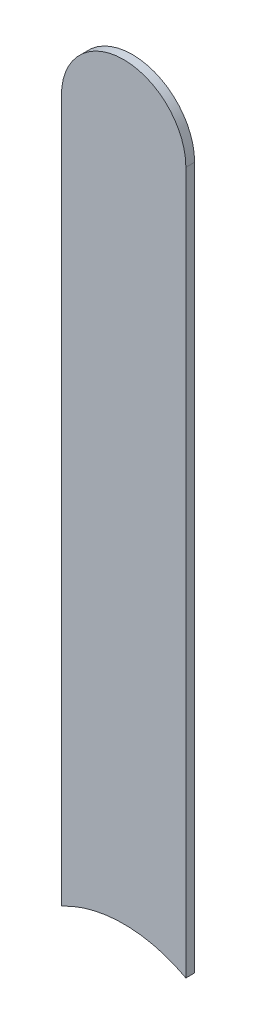
ISO-10303-21;
HEADER;
FILE_DESCRIPTION(('STEP AP214'),'2;1');
FILE_NAME('part.step','',(''),(''),'','','');
FILE_SCHEMA(('AUTOMOTIVE_DESIGN { 1 0 10303 214 1 1 1 1 }'));
ENDSEC;
DATA;
#1=APPLICATION_CONTEXT('core data for automotive mechanical design processes');
#2=APPLICATION_PROTOCOL_DEFINITION('international standard','automotive_design',2000,#1);
#3=PRODUCT_CONTEXT('',#1,'mechanical');
#4=PRODUCT('Part','Part','',(#3));
#5=PRODUCT_RELATED_PRODUCT_CATEGORY('part','',(#4));
#6=PRODUCT_DEFINITION_FORMATION('','',#4);
#7=PRODUCT_DEFINITION_CONTEXT('part definition',#1,'design');
#8=PRODUCT_DEFINITION('design','',#6,#7);
#9=PRODUCT_DEFINITION_SHAPE('','',#8);
#10=(LENGTH_UNIT() NAMED_UNIT(*) SI_UNIT(.MILLI.,.METRE.));
#11=(NAMED_UNIT(*) PLANE_ANGLE_UNIT() SI_UNIT($,.RADIAN.));
#12=(NAMED_UNIT(*) SI_UNIT($,.STERADIAN.) SOLID_ANGLE_UNIT());
#13=UNCERTAINTY_MEASURE_WITH_UNIT(LENGTH_MEASURE(1.E-05),#10,'distance_accuracy_value','');
#14=(GEOMETRIC_REPRESENTATION_CONTEXT(3) GLOBAL_UNCERTAINTY_ASSIGNED_CONTEXT((#13)) GLOBAL_UNIT_ASSIGNED_CONTEXT((#10,
#11,#12)) REPRESENTATION_CONTEXT('',''));
#15=CARTESIAN_POINT('',(0.,0.,0.));
#16=DIRECTION('',(0.,0.,1.));
#17=DIRECTION('',(1.,0.,0.));
#18=AXIS2_PLACEMENT_3D('',#15,#16,#17);
#19=CARTESIAN_POINT('',(126.552,-108.402,-0.035));
#20=DIRECTION('',(1.,0.,0.));
#21=DIRECTION('',(0.,1.,0.));
#22=AXIS2_PLACEMENT_3D('',#19,#20,#21);
#23=PLANE('',#22);
#24=DIRECTION('',(0.,0.,-1.));
#25=VECTOR('',#24,1.);
#26=CARTESIAN_POINT('',(126.552,-111.2223453671,-0.045));
#27=LINE('',#26,#25);
#28=CARTESIAN_POINT('',(126.552,-111.2223453671,0.));
#29=VERTEX_POINT('',#28);
#30=CARTESIAN_POINT('',(126.552,-111.2223453671,-0.035));
#31=VERTEX_POINT('',#30);
#32=EDGE_CURVE('E11',#29,#31,#27,.T.);
#33=ORIENTED_EDGE('',*,*,#32,.F.);
#34=DIRECTION('',(0.,-1.,0.));
#35=VECTOR('',#34,1.);
#36=CARTESIAN_POINT('',(126.552,-108.402,0.));
#37=LINE('',#36,#35);
#38=CARTESIAN_POINT('',(126.552,-108.402,0.));
#39=VERTEX_POINT('',#38);
#40=EDGE_CURVE('E20',#39,#29,#37,.T.);
#41=ORIENTED_EDGE('',*,*,#40,.F.);
#42=DIRECTION('',(0.,0.,1.));
#43=VECTOR('',#42,1.);
#44=CARTESIAN_POINT('',(126.552,-108.402,-0.035));
#45=LINE('',#44,#43);
#46=CARTESIAN_POINT('',(126.552,-108.402,-0.035));
#47=VERTEX_POINT('',#46);
#48=EDGE_CURVE('E105',#47,#39,#45,.T.);
#49=ORIENTED_EDGE('',*,*,#48,.F.);
#50=DIRECTION('',(0.,-1.,0.));
#51=VECTOR('',#50,1.);
#52=CARTESIAN_POINT('',(126.552,-108.402,-0.035));
#53=LINE('',#52,#51);
#54=EDGE_CURVE('E72',#47,#31,#53,.T.);
#55=ORIENTED_EDGE('',*,*,#54,.T.);
#56=EDGE_LOOP('',(#33,#41,#49,#55));
#57=FACE_BOUND('',#56,.T.);
#58=ADVANCED_FACE('F17',(#57),#23,.F.);
#59=CARTESIAN_POINT('',(126.802,-111.684,-0.045));
#60=DIRECTION('',(0.,0.,-1.));
#61=DIRECTION('',(0.,-1.,0.));
#62=AXIS2_PLACEMENT_3D('',#59,#60,#61);
#63=CYLINDRICAL_SURFACE('',#62,0.525);
#64=DIRECTION('',(0.,0.,-1.));
#65=VECTOR('',#64,1.);
#66=CARTESIAN_POINT('',(127.052,-111.2223453671,-0.045));
#67=LINE('',#66,#65);
#68=CARTESIAN_POINT('',(127.052,-111.2223453671,0.));
#69=VERTEX_POINT('',#68);
#70=CARTESIAN_POINT('',(127.052,-111.2223453671,-0.035));
#71=VERTEX_POINT('',#70);
#72=EDGE_CURVE('E85',#69,#71,#67,.T.);
#73=ORIENTED_EDGE('',*,*,#72,.F.);
#74=CARTESIAN_POINT('',(126.802,-111.684,0.));
#75=DIRECTION('',(0.,0.,-1.));
#76=DIRECTION('',(0.,-1.,0.));
#77=AXIS2_PLACEMENT_3D('',#74,#75,#76);
#78=CIRCLE('',#77,0.525);
#79=EDGE_CURVE('E110',#29,#69,#78,.T.);
#80=ORIENTED_EDGE('',*,*,#79,.F.);
#81=ORIENTED_EDGE('',*,*,#32,.T.);
#82=CARTESIAN_POINT('',(126.802,-111.684,-0.035));
#83=DIRECTION('',(0.,0.,-1.));
#84=DIRECTION('',(0.,-1.,0.));
#85=AXIS2_PLACEMENT_3D('',#82,#83,#84);
#86=CIRCLE('',#85,0.525);
#87=EDGE_CURVE('E77',#31,#71,#86,.T.);
#88=ORIENTED_EDGE('',*,*,#87,.T.);
#89=EDGE_LOOP('',(#73,#80,#81,#88));
#90=FACE_BOUND('',#89,.T.);
#91=ADVANCED_FACE('F121',(#90),#63,.F.);
#92=CARTESIAN_POINT('',(127.052,-111.684,0.));
#93=DIRECTION('',(0.,0.,1.));
#94=DIRECTION('',(1.,0.,0.));
#95=AXIS2_PLACEMENT_3D('',#92,#93,#94);
#96=PLANE('',#95);
#97=ORIENTED_EDGE('',*,*,#79,.T.);
#98=DIRECTION('',(0.,1.,0.));
#99=VECTOR('',#98,1.);
#100=CARTESIAN_POINT('',(127.052,-111.684,0.));
#101=LINE('',#100,#99);
#102=CARTESIAN_POINT('',(127.052,-108.402,0.));
#103=VERTEX_POINT('',#102);
#104=EDGE_CURVE('E93',#69,#103,#101,.T.);
#105=ORIENTED_EDGE('',*,*,#104,.T.);
#106=CARTESIAN_POINT('',(126.802,-108.402,0.));
#107=DIRECTION('',(0.,0.,1.));
#108=DIRECTION('',(1.,0.,0.));
#109=AXIS2_PLACEMENT_3D('',#106,#107,#108);
#110=CIRCLE('',#109,0.25);
#111=EDGE_CURVE('E90',#103,#39,#110,.T.);
#112=ORIENTED_EDGE('',*,*,#111,.T.);
#113=ORIENTED_EDGE('',*,*,#40,.T.);
#114=EDGE_LOOP('',(#97,#105,#112,#113));
#115=FACE_BOUND('',#114,.T.);
#116=ADVANCED_FACE('F119',(#115),#96,.T.);
#117=CARTESIAN_POINT('',(126.802,-108.402,-0.035));
#118=DIRECTION('',(0.,0.,-1.));
#119=DIRECTION('',(1.,0.,0.));
#120=AXIS2_PLACEMENT_3D('',#117,#118,#119);
#121=CYLINDRICAL_SURFACE('',#120,0.25);
#122=CARTESIAN_POINT('',(126.802,-108.402,-0.035));
#123=DIRECTION('',(0.,0.,1.));
#124=DIRECTION('',(1.,0.,0.));
#125=AXIS2_PLACEMENT_3D('',#122,#123,#124);
#126=CIRCLE('',#125,0.25);
#127=CARTESIAN_POINT('',(127.052,-108.402,-0.035));
#128=VERTEX_POINT('',#127);
#129=EDGE_CURVE('E66',#128,#47,#126,.T.);
#130=ORIENTED_EDGE('',*,*,#129,.T.);
#131=ORIENTED_EDGE('',*,*,#48,.T.);
#132=ORIENTED_EDGE('',*,*,#111,.F.);
#133=DIRECTION('',(0.,0.,1.));
#134=VECTOR('',#133,1.);
#135=CARTESIAN_POINT('',(127.052,-108.402,-0.035));
#136=LINE('',#135,#134);
#137=EDGE_CURVE('E83',#128,#103,#136,.T.);
#138=ORIENTED_EDGE('',*,*,#137,.F.);
#139=EDGE_LOOP('',(#130,#131,#132,#138));
#140=FACE_BOUND('',#139,.T.);
#141=ADVANCED_FACE('F88',(#140),#121,.T.);
#142=CARTESIAN_POINT('',(127.052,-111.684,-0.035));
#143=DIRECTION('',(0.,0.,1.));
#144=DIRECTION('',(1.,0.,0.));
#145=AXIS2_PLACEMENT_3D('',#142,#143,#144);
#146=PLANE('',#145);
#147=ORIENTED_EDGE('',*,*,#54,.F.);
#148=ORIENTED_EDGE('',*,*,#129,.F.);
#149=DIRECTION('',(0.,1.,0.));
#150=VECTOR('',#149,1.);
#151=CARTESIAN_POINT('',(127.052,-111.684,-0.035));
#152=LINE('',#151,#150);
#153=EDGE_CURVE('E70',#71,#128,#152,.T.);
#154=ORIENTED_EDGE('',*,*,#153,.F.);
#155=ORIENTED_EDGE('',*,*,#87,.F.);
#156=EDGE_LOOP('',(#147,#148,#154,#155));
#157=FACE_BOUND('',#156,.T.);
#158=ADVANCED_FACE('F68',(#157),#146,.F.);
#159=CARTESIAN_POINT('',(127.052,-111.684,-0.035));
#160=DIRECTION('',(-1.,0.,0.));
#161=DIRECTION('',(0.,0.,1.));
#162=AXIS2_PLACEMENT_3D('',#159,#160,#161);
#163=PLANE('',#162);
#164=ORIENTED_EDGE('',*,*,#137,.T.);
#165=ORIENTED_EDGE('',*,*,#104,.F.);
#166=ORIENTED_EDGE('',*,*,#72,.T.);
#167=ORIENTED_EDGE('',*,*,#153,.T.);
#168=EDGE_LOOP('',(#164,#165,#166,#167));
#169=FACE_BOUND('',#168,.T.);
#170=ADVANCED_FACE('F81',(#169),#163,.F.);
#171=CLOSED_SHELL('',(#58,#91,#116,#141,#158,#170));
#172=MANIFOLD_SOLID_BREP('B1',#171);
#173=ADVANCED_BREP_SHAPE_REPRESENTATION('',(#18,#172),#14);
#174=SHAPE_DEFINITION_REPRESENTATION(#9,#173);
ENDSEC;
END-ISO-10303-21;
